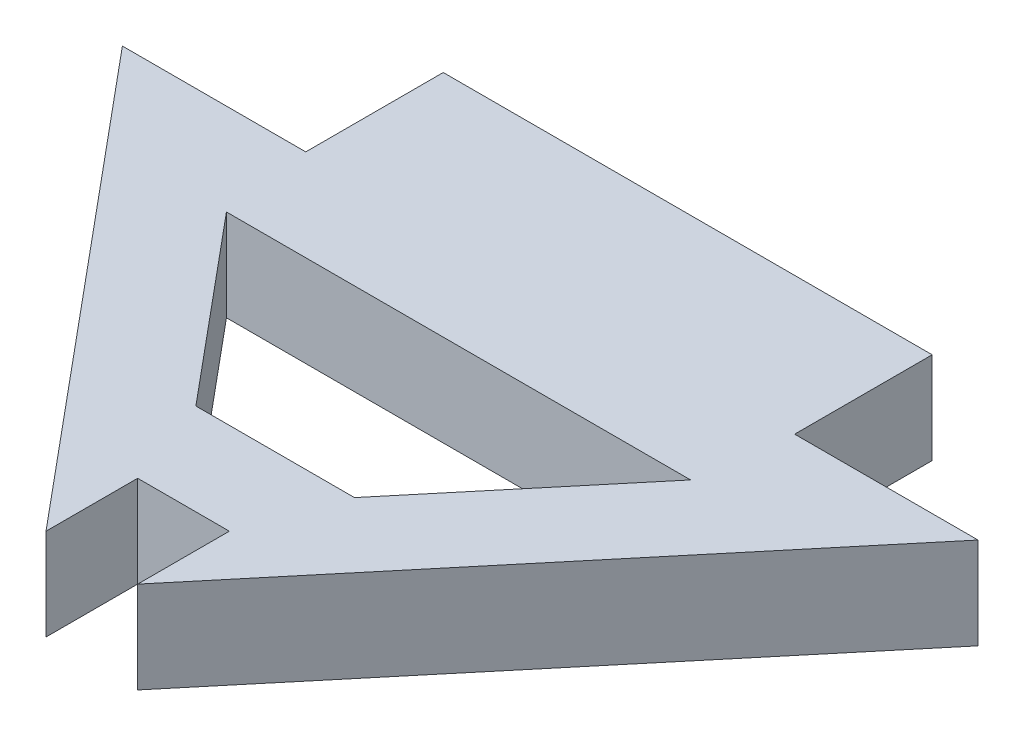
ISO-10303-21;
HEADER;
FILE_DESCRIPTION(('STEP AP214'),'2;1');
FILE_NAME('part.step','',(''),(''),'','','');
FILE_SCHEMA(('AUTOMOTIVE_DESIGN { 1 0 10303 214 1 1 1 1 }'));
ENDSEC;
DATA;
#1=APPLICATION_CONTEXT('core data for automotive mechanical design processes');
#2=APPLICATION_PROTOCOL_DEFINITION('international standard','automotive_design',2000,#1);
#3=PRODUCT_CONTEXT('',#1,'mechanical');
#4=PRODUCT('Part','Part','',(#3));
#5=PRODUCT_RELATED_PRODUCT_CATEGORY('part','',(#4));
#6=PRODUCT_DEFINITION_FORMATION('','',#4);
#7=PRODUCT_DEFINITION_CONTEXT('part definition',#1,'design');
#8=PRODUCT_DEFINITION('design','',#6,#7);
#9=PRODUCT_DEFINITION_SHAPE('','',#8);
#10=(LENGTH_UNIT() NAMED_UNIT(*) SI_UNIT(.MILLI.,.METRE.));
#11=(NAMED_UNIT(*) PLANE_ANGLE_UNIT() SI_UNIT($,.RADIAN.));
#12=(NAMED_UNIT(*) SI_UNIT($,.STERADIAN.) SOLID_ANGLE_UNIT());
#13=UNCERTAINTY_MEASURE_WITH_UNIT(LENGTH_MEASURE(1.E-05),#10,'distance_accuracy_value','');
#14=(GEOMETRIC_REPRESENTATION_CONTEXT(3) GLOBAL_UNCERTAINTY_ASSIGNED_CONTEXT((#13)) GLOBAL_UNIT_ASSIGNED_CONTEXT((#10,
#11,#12)) REPRESENTATION_CONTEXT('',''));
#15=CARTESIAN_POINT('',(0.,0.,0.));
#16=DIRECTION('',(0.,0.,1.));
#17=DIRECTION('',(1.,0.,0.));
#18=AXIS2_PLACEMENT_3D('',#15,#16,#17);
#19=CARTESIAN_POINT('',(0.,3.,0.));
#20=DIRECTION('',(0.,-1.,0.));
#21=DIRECTION('',(0.,0.,-1.));
#22=AXIS2_PLACEMENT_3D('',#19,#20,#21);
#23=PLANE('',#22);
#24=DIRECTION('',(0.64018439966448,0.,-0.768221279597376));
#25=VECTOR('',#24,1.);
#26=CARTESIAN_POINT('',(9.57948121573199,3.,11.9712742278367));
#27=LINE('',#26,#25);
#28=CARTESIAN_POINT('',(9.57948121573199,3.,11.9712742278367));
#29=VERTEX_POINT('',#28);
#30=CARTESIAN_POINT('',(22.079481215732,3.,-3.02872577216331));
#31=VERTEX_POINT('',#30);
#32=EDGE_CURVE('E172',#29,#31,#27,.T.);
#33=ORIENTED_EDGE('',*,*,#32,.T.);
#34=DIRECTION('',(-1.,0.,0.));
#35=VECTOR('',#34,1.);
#36=CARTESIAN_POINT('',(22.079481215732,3.,-3.02872577216331));
#37=LINE('',#36,#35);
#38=CARTESIAN_POINT('',(16.079481215732,3.,-3.02872577216331));
#39=VERTEX_POINT('',#38);
#40=EDGE_CURVE('E175',#31,#39,#37,.T.);
#41=ORIENTED_EDGE('',*,*,#40,.T.);
#42=DIRECTION('',(0.,0.,-1.));
#43=VECTOR('',#42,1.);
#44=CARTESIAN_POINT('',(16.079481215732,3.,-3.02872577216331));
#45=LINE('',#44,#43);
#46=CARTESIAN_POINT('',(16.079481215732,3.,-7.52872577216331));
#47=VERTEX_POINT('',#46);
#48=EDGE_CURVE('E178',#39,#47,#45,.T.);
#49=ORIENTED_EDGE('',*,*,#48,.T.);
#50=DIRECTION('',(-1.,0.,0.));
#51=VECTOR('',#50,1.);
#52=CARTESIAN_POINT('',(16.079481215732,3.,-7.52872577216331));
#53=LINE('',#52,#51);
#54=CARTESIAN_POINT('',(0.0794812157319813,3.,-7.52872577216331));
#55=VERTEX_POINT('',#54);
#56=EDGE_CURVE('E180',#47,#55,#53,.T.);
#57=ORIENTED_EDGE('',*,*,#56,.T.);
#58=DIRECTION('',(0.,0.,1.));
#59=VECTOR('',#58,1.);
#60=CARTESIAN_POINT('',(0.0794812157319813,3.,-7.52872577216331));
#61=LINE('',#60,#59);
#62=CARTESIAN_POINT('',(0.0794812157319848,3.,-3.02872577216331));
#63=VERTEX_POINT('',#62);
#64=EDGE_CURVE('E182',#55,#63,#61,.T.);
#65=ORIENTED_EDGE('',*,*,#64,.T.);
#66=DIRECTION('',(-1.,0.,0.));
#67=VECTOR('',#66,1.);
#68=CARTESIAN_POINT('',(0.0794812157319848,3.,-3.02872577216331));
#69=LINE('',#68,#67);
#70=CARTESIAN_POINT('',(-5.92051878426801,3.,-3.02872577216331));
#71=VERTEX_POINT('',#70);
#72=EDGE_CURVE('E184',#63,#71,#69,.T.);
#73=ORIENTED_EDGE('',*,*,#72,.T.);
#74=DIRECTION('',(0.64018439966448,0.,0.768221279597376));
#75=VECTOR('',#74,1.);
#76=CARTESIAN_POINT('',(-5.92051878426801,3.,-3.02872577216331));
#77=LINE('',#76,#75);
#78=CARTESIAN_POINT('',(6.57948121573198,3.,11.9712742278367));
#79=VERTEX_POINT('',#78);
#80=EDGE_CURVE('E186',#71,#79,#77,.T.);
#81=ORIENTED_EDGE('',*,*,#80,.T.);
#82=DIRECTION('',(0.,0.,-1.));
#83=VECTOR('',#82,1.);
#84=CARTESIAN_POINT('',(6.57948121573198,3.,11.9712742278367));
#85=LINE('',#84,#83);
#86=CARTESIAN_POINT('',(6.57948121573198,3.,8.97127422783669));
#87=VERTEX_POINT('',#86);
#88=EDGE_CURVE('E188',#79,#87,#85,.T.);
#89=ORIENTED_EDGE('',*,*,#88,.T.);
#90=DIRECTION('',(1.,0.,0.));
#91=VECTOR('',#90,1.);
#92=CARTESIAN_POINT('',(6.57948121573198,3.,8.97127422783669));
#93=LINE('',#92,#91);
#94=CARTESIAN_POINT('',(9.57948121573199,3.,8.97127422783669));
#95=VERTEX_POINT('',#94);
#96=EDGE_CURVE('E190',#87,#95,#93,.T.);
#97=ORIENTED_EDGE('',*,*,#96,.T.);
#98=DIRECTION('',(0.,0.,1.));
#99=VECTOR('',#98,1.);
#100=CARTESIAN_POINT('',(9.57948121573199,3.,8.97127422783669));
#101=LINE('',#100,#99);
#102=EDGE_CURVE('E192',#95,#29,#101,.T.);
#103=ORIENTED_EDGE('',*,*,#102,.T.);
#104=EDGE_LOOP('',(#33,#41,#49,#57,#65,#73,#81,#89,#97,#103));
#105=FACE_BOUND('',#104,.T.);
#106=DIRECTION('',(0.64018439966448,0.,-0.768221279597376));
#107=VECTOR('',#106,1.);
#108=CARTESIAN_POINT('',(10.6743563777787,3.,5.97127422783669));
#109=LINE('',#108,#107);
#110=CARTESIAN_POINT('',(10.6743563777787,3.,5.97127422783669));
#111=VERTEX_POINT('',#110);
#112=CARTESIAN_POINT('',(15.6743563777787,3.,-0.0287257721633136));
#113=VERTEX_POINT('',#112);
#114=EDGE_CURVE('E136',#111,#113,#109,.T.);
#115=ORIENTED_EDGE('',*,*,#114,.F.);
#116=DIRECTION('',(1.,0.,0.));
#117=VECTOR('',#116,1.);
#118=CARTESIAN_POINT('',(5.48460605368531,3.,5.97127422783669));
#119=LINE('',#118,#117);
#120=CARTESIAN_POINT('',(5.48460605368531,3.,5.97127422783669));
#121=VERTEX_POINT('',#120);
#122=EDGE_CURVE('E158',#121,#111,#119,.T.);
#123=ORIENTED_EDGE('',*,*,#122,.F.);
#124=DIRECTION('',(0.64018439966448,0.,0.768221279597376));
#125=VECTOR('',#124,1.);
#126=CARTESIAN_POINT('',(0.484606053685315,3.,-0.0287257721633119));
#127=LINE('',#126,#125);
#128=CARTESIAN_POINT('',(0.484606053685315,3.,-0.0287257721633119));
#129=VERTEX_POINT('',#128);
#130=EDGE_CURVE('E156',#129,#121,#127,.T.);
#131=ORIENTED_EDGE('',*,*,#130,.F.);
#132=DIRECTION('',(-1.,0.,0.));
#133=VECTOR('',#132,1.);
#134=CARTESIAN_POINT('',(15.6743563777787,3.,-0.0287257721633136));
#135=LINE('',#134,#133);
#136=EDGE_CURVE('E144',#113,#129,#135,.T.);
#137=ORIENTED_EDGE('',*,*,#136,.F.);
#138=EDGE_LOOP('',(#115,#123,#131,#137));
#139=FACE_BOUND('',#138,.T.);
#140=ADVANCED_FACE('F35',(#105,#139),#23,.F.);
#141=CARTESIAN_POINT('',(0.,0.,0.));
#142=DIRECTION('',(0.,-1.,0.));
#143=DIRECTION('',(0.,0.,-1.));
#144=AXIS2_PLACEMENT_3D('',#141,#142,#143);
#145=PLANE('',#144);
#146=DIRECTION('',(0.64018439966448,0.,-0.768221279597376));
#147=VECTOR('',#146,1.);
#148=CARTESIAN_POINT('',(9.57948121573199,0.,11.9712742278367));
#149=LINE('',#148,#147);
#150=CARTESIAN_POINT('',(9.57948121573199,0.,11.9712742278367));
#151=VERTEX_POINT('',#150);
#152=CARTESIAN_POINT('',(22.079481215732,0.,-3.02872577216331));
#153=VERTEX_POINT('',#152);
#154=EDGE_CURVE('E152',#151,#153,#149,.T.);
#155=ORIENTED_EDGE('',*,*,#154,.F.);
#156=DIRECTION('',(0.,0.,1.));
#157=VECTOR('',#156,1.);
#158=CARTESIAN_POINT('',(9.57948121573199,0.,8.97127422783669));
#159=LINE('',#158,#157);
#160=CARTESIAN_POINT('',(9.57948121573199,0.,8.97127422783669));
#161=VERTEX_POINT('',#160);
#162=EDGE_CURVE('E176',#161,#151,#159,.T.);
#163=ORIENTED_EDGE('',*,*,#162,.F.);
#164=DIRECTION('',(1.,0.,0.));
#165=VECTOR('',#164,1.);
#166=CARTESIAN_POINT('',(6.57948121573198,0.,8.97127422783669));
#167=LINE('',#166,#165);
#168=CARTESIAN_POINT('',(6.57948121573198,0.,8.97127422783669));
#169=VERTEX_POINT('',#168);
#170=EDGE_CURVE('E211',#169,#161,#167,.T.);
#171=ORIENTED_EDGE('',*,*,#170,.F.);
#172=DIRECTION('',(0.,0.,-1.));
#173=VECTOR('',#172,1.);
#174=CARTESIAN_POINT('',(6.57948121573198,0.,11.9712742278367));
#175=LINE('',#174,#173);
#176=CARTESIAN_POINT('',(6.57948121573198,0.,11.9712742278367));
#177=VERTEX_POINT('',#176);
#178=EDGE_CURVE('E209',#177,#169,#175,.T.);
#179=ORIENTED_EDGE('',*,*,#178,.F.);
#180=DIRECTION('',(0.64018439966448,0.,0.768221279597376));
#181=VECTOR('',#180,1.);
#182=CARTESIAN_POINT('',(-5.92051878426801,0.,-3.02872577216331));
#183=LINE('',#182,#181);
#184=CARTESIAN_POINT('',(-5.92051878426801,0.,-3.02872577216331));
#185=VERTEX_POINT('',#184);
#186=EDGE_CURVE('E207',#185,#177,#183,.T.);
#187=ORIENTED_EDGE('',*,*,#186,.F.);
#188=DIRECTION('',(-1.,0.,0.));
#189=VECTOR('',#188,1.);
#190=CARTESIAN_POINT('',(0.0794812157319848,0.,-3.02872577216331));
#191=LINE('',#190,#189);
#192=CARTESIAN_POINT('',(0.0794812157319848,0.,-3.02872577216331));
#193=VERTEX_POINT('',#192);
#194=EDGE_CURVE('E205',#193,#185,#191,.T.);
#195=ORIENTED_EDGE('',*,*,#194,.F.);
#196=DIRECTION('',(0.,0.,1.));
#197=VECTOR('',#196,1.);
#198=CARTESIAN_POINT('',(0.0794812157319813,0.,-7.52872577216331));
#199=LINE('',#198,#197);
#200=CARTESIAN_POINT('',(0.0794812157319813,0.,-7.52872577216331));
#201=VERTEX_POINT('',#200);
#202=EDGE_CURVE('E203',#201,#193,#199,.T.);
#203=ORIENTED_EDGE('',*,*,#202,.F.);
#204=DIRECTION('',(-1.,0.,0.));
#205=VECTOR('',#204,1.);
#206=CARTESIAN_POINT('',(16.079481215732,0.,-7.52872577216331));
#207=LINE('',#206,#205);
#208=CARTESIAN_POINT('',(16.079481215732,0.,-7.52872577216331));
#209=VERTEX_POINT('',#208);
#210=EDGE_CURVE('E201',#209,#201,#207,.T.);
#211=ORIENTED_EDGE('',*,*,#210,.F.);
#212=DIRECTION('',(0.,0.,-1.));
#213=VECTOR('',#212,1.);
#214=CARTESIAN_POINT('',(16.079481215732,0.,-3.02872577216331));
#215=LINE('',#214,#213);
#216=CARTESIAN_POINT('',(16.079481215732,0.,-3.02872577216331));
#217=VERTEX_POINT('',#216);
#218=EDGE_CURVE('E199',#217,#209,#215,.T.);
#219=ORIENTED_EDGE('',*,*,#218,.F.);
#220=DIRECTION('',(-1.,0.,0.));
#221=VECTOR('',#220,1.);
#222=CARTESIAN_POINT('',(22.079481215732,0.,-3.02872577216331));
#223=LINE('',#222,#221);
#224=EDGE_CURVE('E197',#153,#217,#223,.T.);
#225=ORIENTED_EDGE('',*,*,#224,.F.);
#226=EDGE_LOOP('',(#155,#163,#171,#179,#187,#195,#203,#211,#219,#225));
#227=FACE_BOUND('',#226,.T.);
#228=DIRECTION('',(1.,0.,0.));
#229=VECTOR('',#228,1.);
#230=CARTESIAN_POINT('',(5.48460605368531,0.,5.97127422783669));
#231=LINE('',#230,#229);
#232=CARTESIAN_POINT('',(5.48460605368531,0.,5.97127422783669));
#233=VERTEX_POINT('',#232);
#234=CARTESIAN_POINT('',(10.6743563777787,0.,5.97127422783669));
#235=VERTEX_POINT('',#234);
#236=EDGE_CURVE('E145',#233,#235,#231,.T.);
#237=ORIENTED_EDGE('',*,*,#236,.T.);
#238=DIRECTION('',(0.64018439966448,0.,-0.768221279597376));
#239=VECTOR('',#238,1.);
#240=CARTESIAN_POINT('',(10.6743563777787,0.,5.97127422783669));
#241=LINE('',#240,#239);
#242=CARTESIAN_POINT('',(15.6743563777787,0.,-0.0287257721633136));
#243=VERTEX_POINT('',#242);
#244=EDGE_CURVE('E58',#235,#243,#241,.T.);
#245=ORIENTED_EDGE('',*,*,#244,.T.);
#246=DIRECTION('',(-1.,0.,0.));
#247=VECTOR('',#246,1.);
#248=CARTESIAN_POINT('',(15.6743563777787,0.,-0.0287257721633136));
#249=LINE('',#248,#247);
#250=CARTESIAN_POINT('',(0.484606053685315,0.,-0.0287257721633119));
#251=VERTEX_POINT('',#250);
#252=EDGE_CURVE('E151',#243,#251,#249,.T.);
#253=ORIENTED_EDGE('',*,*,#252,.T.);
#254=DIRECTION('',(0.64018439966448,0.,0.768221279597376));
#255=VECTOR('',#254,1.);
#256=CARTESIAN_POINT('',(0.484606053685315,0.,-0.0287257721633119));
#257=LINE('',#256,#255);
#258=EDGE_CURVE('E164',#251,#233,#257,.T.);
#259=ORIENTED_EDGE('',*,*,#258,.T.);
#260=EDGE_LOOP('',(#237,#245,#253,#259));
#261=FACE_BOUND('',#260,.T.);
#262=ADVANCED_FACE('F247',(#227,#261),#145,.T.);
#263=CARTESIAN_POINT('',(9.57948121573199,3.,11.9712742278367));
#264=DIRECTION('',(-0.768221279597376,0.,-0.64018439966448));
#265=DIRECTION('',(-0.64018439966448,0.,0.768221279597376));
#266=AXIS2_PLACEMENT_3D('',#263,#264,#265);
#267=PLANE('',#266);
#268=ORIENTED_EDGE('',*,*,#154,.T.);
#269=DIRECTION('',(0.,-1.,0.));
#270=VECTOR('',#269,1.);
#271=CARTESIAN_POINT('',(22.079481215732,3.,-3.02872577216331));
#272=LINE('',#271,#270);
#273=EDGE_CURVE('E11',#31,#153,#272,.T.);
#274=ORIENTED_EDGE('',*,*,#273,.F.);
#275=ORIENTED_EDGE('',*,*,#32,.F.);
#276=DIRECTION('',(0.,-1.,0.));
#277=VECTOR('',#276,1.);
#278=CARTESIAN_POINT('',(9.57948121573199,3.,11.9712742278367));
#279=LINE('',#278,#277);
#280=EDGE_CURVE('E194',#29,#151,#279,.T.);
#281=ORIENTED_EDGE('',*,*,#280,.T.);
#282=EDGE_LOOP('',(#268,#274,#275,#281));
#283=FACE_BOUND('',#282,.T.);
#284=ADVANCED_FACE('F37',(#283),#267,.F.);
#285=CARTESIAN_POINT('',(22.079481215732,3.,-3.02872577216331));
#286=DIRECTION('',(0.,0.,1.));
#287=DIRECTION('',(1.,0.,0.));
#288=AXIS2_PLACEMENT_3D('',#285,#286,#287);
#289=PLANE('',#288);
#290=ORIENTED_EDGE('',*,*,#224,.T.);
#291=DIRECTION('',(0.,-1.,0.));
#292=VECTOR('',#291,1.);
#293=CARTESIAN_POINT('',(16.079481215732,3.,-3.02872577216331));
#294=LINE('',#293,#292);
#295=EDGE_CURVE('E43',#39,#217,#294,.T.);
#296=ORIENTED_EDGE('',*,*,#295,.F.);
#297=ORIENTED_EDGE('',*,*,#40,.F.);
#298=ORIENTED_EDGE('',*,*,#273,.T.);
#299=EDGE_LOOP('',(#290,#296,#297,#298));
#300=FACE_BOUND('',#299,.T.);
#301=ADVANCED_FACE('F264',(#300),#289,.F.);
#302=CARTESIAN_POINT('',(16.079481215732,3.,-3.02872577216331));
#303=DIRECTION('',(-1.,0.,0.));
#304=DIRECTION('',(0.,0.,1.));
#305=AXIS2_PLACEMENT_3D('',#302,#303,#304);
#306=PLANE('',#305);
#307=ORIENTED_EDGE('',*,*,#218,.T.);
#308=DIRECTION('',(0.,-1.,0.));
#309=VECTOR('',#308,1.);
#310=CARTESIAN_POINT('',(16.079481215732,3.,-7.52872577216331));
#311=LINE('',#310,#309);
#312=EDGE_CURVE('E234',#47,#209,#311,.T.);
#313=ORIENTED_EDGE('',*,*,#312,.F.);
#314=ORIENTED_EDGE('',*,*,#48,.F.);
#315=ORIENTED_EDGE('',*,*,#295,.T.);
#316=EDGE_LOOP('',(#307,#313,#314,#315));
#317=FACE_BOUND('',#316,.T.);
#318=ADVANCED_FACE('F241',(#317),#306,.F.);
#319=CARTESIAN_POINT('',(16.079481215732,3.,-7.52872577216331));
#320=DIRECTION('',(0.,0.,1.));
#321=DIRECTION('',(1.,0.,0.));
#322=AXIS2_PLACEMENT_3D('',#319,#320,#321);
#323=PLANE('',#322);
#324=ORIENTED_EDGE('',*,*,#210,.T.);
#325=DIRECTION('',(0.,-1.,0.));
#326=VECTOR('',#325,1.);
#327=CARTESIAN_POINT('',(0.0794812157319813,3.,-7.52872577216331));
#328=LINE('',#327,#326);
#329=EDGE_CURVE('E231',#55,#201,#328,.T.);
#330=ORIENTED_EDGE('',*,*,#329,.F.);
#331=ORIENTED_EDGE('',*,*,#56,.F.);
#332=ORIENTED_EDGE('',*,*,#312,.T.);
#333=EDGE_LOOP('',(#324,#330,#331,#332));
#334=FACE_BOUND('',#333,.T.);
#335=ADVANCED_FACE('F253',(#334),#323,.F.);
#336=CARTESIAN_POINT('',(0.0794812157319813,3.,-7.52872577216331));
#337=DIRECTION('',(1.,0.,0.));
#338=DIRECTION('',(0.,0.,-1.));
#339=AXIS2_PLACEMENT_3D('',#336,#337,#338);
#340=PLANE('',#339);
#341=ORIENTED_EDGE('',*,*,#202,.T.);
#342=DIRECTION('',(0.,-1.,0.));
#343=VECTOR('',#342,1.);
#344=CARTESIAN_POINT('',(0.0794812157319848,3.,-3.02872577216331));
#345=LINE('',#344,#343);
#346=EDGE_CURVE('E228',#63,#193,#345,.T.);
#347=ORIENTED_EDGE('',*,*,#346,.F.);
#348=ORIENTED_EDGE('',*,*,#64,.F.);
#349=ORIENTED_EDGE('',*,*,#329,.T.);
#350=EDGE_LOOP('',(#341,#347,#348,#349));
#351=FACE_BOUND('',#350,.T.);
#352=ADVANCED_FACE('F257',(#351),#340,.F.);
#353=CARTESIAN_POINT('',(0.0794812157319848,3.,-3.02872577216331));
#354=DIRECTION('',(0.,0.,1.));
#355=DIRECTION('',(1.,0.,0.));
#356=AXIS2_PLACEMENT_3D('',#353,#354,#355);
#357=PLANE('',#356);
#358=ORIENTED_EDGE('',*,*,#194,.T.);
#359=DIRECTION('',(0.,-1.,0.));
#360=VECTOR('',#359,1.);
#361=CARTESIAN_POINT('',(-5.92051878426801,3.,-3.02872577216331));
#362=LINE('',#361,#360);
#363=EDGE_CURVE('E225',#71,#185,#362,.T.);
#364=ORIENTED_EDGE('',*,*,#363,.F.);
#365=ORIENTED_EDGE('',*,*,#72,.F.);
#366=ORIENTED_EDGE('',*,*,#346,.T.);
#367=EDGE_LOOP('',(#358,#364,#365,#366));
#368=FACE_BOUND('',#367,.T.);
#369=ADVANCED_FACE('F287',(#368),#357,.F.);
#370=CARTESIAN_POINT('',(-5.92051878426801,3.,-3.02872577216331));
#371=DIRECTION('',(0.768221279597376,0.,-0.64018439966448));
#372=DIRECTION('',(-0.64018439966448,0.,-0.768221279597376));
#373=AXIS2_PLACEMENT_3D('',#370,#371,#372);
#374=PLANE('',#373);
#375=ORIENTED_EDGE('',*,*,#186,.T.);
#376=DIRECTION('',(0.,-1.,0.));
#377=VECTOR('',#376,1.);
#378=CARTESIAN_POINT('',(6.57948121573198,3.,11.9712742278367));
#379=LINE('',#378,#377);
#380=EDGE_CURVE('E222',#79,#177,#379,.T.);
#381=ORIENTED_EDGE('',*,*,#380,.F.);
#382=ORIENTED_EDGE('',*,*,#80,.F.);
#383=ORIENTED_EDGE('',*,*,#363,.T.);
#384=EDGE_LOOP('',(#375,#381,#382,#383));
#385=FACE_BOUND('',#384,.T.);
#386=ADVANCED_FACE('F284',(#385),#374,.F.);
#387=CARTESIAN_POINT('',(6.57948121573198,3.,11.9712742278367));
#388=DIRECTION('',(-1.,0.,0.));
#389=DIRECTION('',(0.,0.,1.));
#390=AXIS2_PLACEMENT_3D('',#387,#388,#389);
#391=PLANE('',#390);
#392=ORIENTED_EDGE('',*,*,#178,.T.);
#393=DIRECTION('',(0.,-1.,0.));
#394=VECTOR('',#393,1.);
#395=CARTESIAN_POINT('',(6.57948121573198,3.,8.97127422783669));
#396=LINE('',#395,#394);
#397=EDGE_CURVE('E219',#87,#169,#396,.T.);
#398=ORIENTED_EDGE('',*,*,#397,.F.);
#399=ORIENTED_EDGE('',*,*,#88,.F.);
#400=ORIENTED_EDGE('',*,*,#380,.T.);
#401=EDGE_LOOP('',(#392,#398,#399,#400));
#402=FACE_BOUND('',#401,.T.);
#403=ADVANCED_FACE('F280',(#402),#391,.F.);
#404=CARTESIAN_POINT('',(6.57948121573198,3.,8.97127422783669));
#405=DIRECTION('',(0.,0.,-1.));
#406=DIRECTION('',(-1.,0.,0.));
#407=AXIS2_PLACEMENT_3D('',#404,#405,#406);
#408=PLANE('',#407);
#409=ORIENTED_EDGE('',*,*,#170,.T.);
#410=DIRECTION('',(0.,-1.,0.));
#411=VECTOR('',#410,1.);
#412=CARTESIAN_POINT('',(9.57948121573199,3.,8.97127422783669));
#413=LINE('',#412,#411);
#414=EDGE_CURVE('E216',#95,#161,#413,.T.);
#415=ORIENTED_EDGE('',*,*,#414,.F.);
#416=ORIENTED_EDGE('',*,*,#96,.F.);
#417=ORIENTED_EDGE('',*,*,#397,.T.);
#418=EDGE_LOOP('',(#409,#415,#416,#417));
#419=FACE_BOUND('',#418,.T.);
#420=ADVANCED_FACE('F276',(#419),#408,.F.);
#421=CARTESIAN_POINT('',(9.57948121573199,3.,8.97127422783669));
#422=DIRECTION('',(1.,0.,0.));
#423=DIRECTION('',(0.,0.,-1.));
#424=AXIS2_PLACEMENT_3D('',#421,#422,#423);
#425=PLANE('',#424);
#426=ORIENTED_EDGE('',*,*,#162,.T.);
#427=ORIENTED_EDGE('',*,*,#280,.F.);
#428=ORIENTED_EDGE('',*,*,#102,.F.);
#429=ORIENTED_EDGE('',*,*,#414,.T.);
#430=EDGE_LOOP('',(#426,#427,#428,#429));
#431=FACE_BOUND('',#430,.T.);
#432=ADVANCED_FACE('F271',(#431),#425,.F.);
#433=CARTESIAN_POINT('',(10.6743563777787,3.,5.97127422783669));
#434=DIRECTION('',(-0.768221279597376,0.,-0.64018439966448));
#435=DIRECTION('',(-0.64018439966448,0.,0.768221279597376));
#436=AXIS2_PLACEMENT_3D('',#433,#434,#435);
#437=PLANE('',#436);
#438=ORIENTED_EDGE('',*,*,#244,.F.);
#439=DIRECTION('',(0.,-1.,0.));
#440=VECTOR('',#439,1.);
#441=CARTESIAN_POINT('',(10.6743563777787,3.,5.97127422783669));
#442=LINE('',#441,#440);
#443=EDGE_CURVE('E140',#111,#235,#442,.T.);
#444=ORIENTED_EDGE('',*,*,#443,.F.);
#445=ORIENTED_EDGE('',*,*,#114,.T.);
#446=DIRECTION('',(0.,-1.,0.));
#447=VECTOR('',#446,1.);
#448=CARTESIAN_POINT('',(15.6743563777787,3.,-0.0287257721633136));
#449=LINE('',#448,#447);
#450=EDGE_CURVE('E139',#113,#243,#449,.T.);
#451=ORIENTED_EDGE('',*,*,#450,.T.);
#452=EDGE_LOOP('',(#438,#444,#445,#451));
#453=FACE_BOUND('',#452,.T.);
#454=ADVANCED_FACE('F138',(#453),#437,.T.);
#455=CARTESIAN_POINT('',(15.6743563777787,3.,-0.0287257721633136));
#456=DIRECTION('',(0.,0.,1.));
#457=DIRECTION('',(1.,0.,0.));
#458=AXIS2_PLACEMENT_3D('',#455,#456,#457);
#459=PLANE('',#458);
#460=ORIENTED_EDGE('',*,*,#252,.F.);
#461=ORIENTED_EDGE('',*,*,#450,.F.);
#462=ORIENTED_EDGE('',*,*,#136,.T.);
#463=DIRECTION('',(0.,-1.,0.));
#464=VECTOR('',#463,1.);
#465=CARTESIAN_POINT('',(0.484606053685315,3.,-0.0287257721633119));
#466=LINE('',#465,#464);
#467=EDGE_CURVE('E153',#129,#251,#466,.T.);
#468=ORIENTED_EDGE('',*,*,#467,.T.);
#469=EDGE_LOOP('',(#460,#461,#462,#468));
#470=FACE_BOUND('',#469,.T.);
#471=ADVANCED_FACE('F148',(#470),#459,.T.);
#472=CARTESIAN_POINT('',(0.484606053685315,3.,-0.0287257721633119));
#473=DIRECTION('',(0.768221279597376,0.,-0.64018439966448));
#474=DIRECTION('',(-0.64018439966448,0.,-0.768221279597376));
#475=AXIS2_PLACEMENT_3D('',#472,#473,#474);
#476=PLANE('',#475);
#477=ORIENTED_EDGE('',*,*,#258,.F.);
#478=ORIENTED_EDGE('',*,*,#467,.F.);
#479=ORIENTED_EDGE('',*,*,#130,.T.);
#480=DIRECTION('',(0.,-1.,0.));
#481=VECTOR('',#480,1.);
#482=CARTESIAN_POINT('',(5.48460605368531,3.,5.97127422783669));
#483=LINE('',#482,#481);
#484=EDGE_CURVE('E50',#121,#233,#483,.T.);
#485=ORIENTED_EDGE('',*,*,#484,.T.);
#486=EDGE_LOOP('',(#477,#478,#479,#485));
#487=FACE_BOUND('',#486,.T.);
#488=ADVANCED_FACE('F333',(#487),#476,.T.);
#489=CARTESIAN_POINT('',(5.48460605368531,3.,5.97127422783669));
#490=DIRECTION('',(0.,0.,-1.));
#491=DIRECTION('',(-1.,0.,0.));
#492=AXIS2_PLACEMENT_3D('',#489,#490,#491);
#493=PLANE('',#492);
#494=ORIENTED_EDGE('',*,*,#236,.F.);
#495=ORIENTED_EDGE('',*,*,#484,.F.);
#496=ORIENTED_EDGE('',*,*,#122,.T.);
#497=ORIENTED_EDGE('',*,*,#443,.T.);
#498=EDGE_LOOP('',(#494,#495,#496,#497));
#499=FACE_BOUND('',#498,.T.);
#500=ADVANCED_FACE('F339',(#499),#493,.T.);
#501=CLOSED_SHELL('',(#140,#262,#284,#301,#318,#335,#352,#369,#386,#403,#420,#432,#454,#471,
#488,#500));
#502=MANIFOLD_SOLID_BREP('B2',#501);
#503=ADVANCED_BREP_SHAPE_REPRESENTATION('',(#18,#502),#14);
#504=SHAPE_DEFINITION_REPRESENTATION(#9,#503);
ENDSEC;
END-ISO-10303-21;
